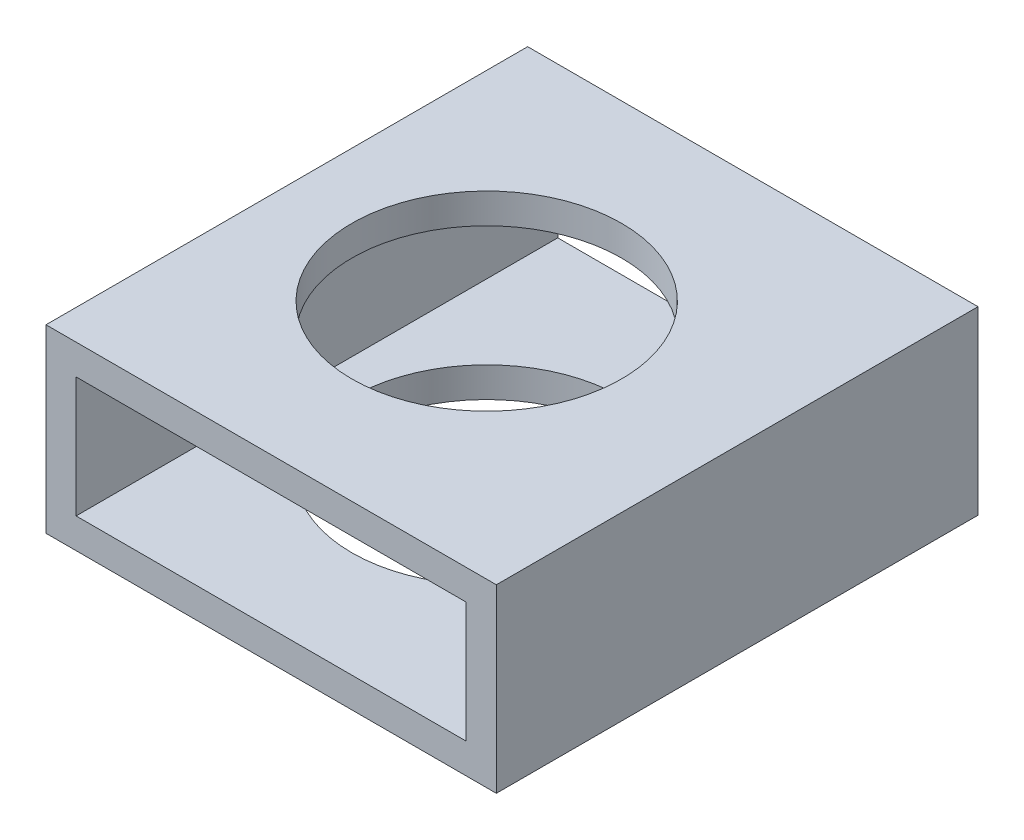
ISO-10303-21;
HEADER;
FILE_DESCRIPTION(('STEP AP214'),'2;1');
FILE_NAME('part.step','',(''),(''),'','','');
FILE_SCHEMA(('AUTOMOTIVE_DESIGN { 1 0 10303 214 1 1 1 1 }'));
ENDSEC;
DATA;
#1=APPLICATION_CONTEXT('core data for automotive mechanical design processes');
#2=APPLICATION_PROTOCOL_DEFINITION('international standard','automotive_design',2000,#1);
#3=PRODUCT_CONTEXT('',#1,'mechanical');
#4=PRODUCT('Part','Part','',(#3));
#5=PRODUCT_RELATED_PRODUCT_CATEGORY('part','',(#4));
#6=PRODUCT_DEFINITION_FORMATION('','',#4);
#7=PRODUCT_DEFINITION_CONTEXT('part definition',#1,'design');
#8=PRODUCT_DEFINITION('design','',#6,#7);
#9=PRODUCT_DEFINITION_SHAPE('','',#8);
#10=(LENGTH_UNIT() NAMED_UNIT(*) SI_UNIT(.MILLI.,.METRE.));
#11=(NAMED_UNIT(*) PLANE_ANGLE_UNIT() SI_UNIT($,.RADIAN.));
#12=(NAMED_UNIT(*) SI_UNIT($,.STERADIAN.) SOLID_ANGLE_UNIT());
#13=UNCERTAINTY_MEASURE_WITH_UNIT(LENGTH_MEASURE(1.E-05),#10,'distance_accuracy_value','');
#14=(GEOMETRIC_REPRESENTATION_CONTEXT(3) GLOBAL_UNCERTAINTY_ASSIGNED_CONTEXT((#13)) GLOBAL_UNIT_ASSIGNED_CONTEXT((#10,
#11,#12)) REPRESENTATION_CONTEXT('',''));
#15=CARTESIAN_POINT('',(0.,0.,0.));
#16=DIRECTION('',(0.,0.,1.));
#17=DIRECTION('',(1.,0.,0.));
#18=AXIS2_PLACEMENT_3D('',#15,#16,#17);
#19=CARTESIAN_POINT('',(-54.2622987401615,21.1125464261386,50.8));
#20=DIRECTION('',(1.,0.,0.));
#21=DIRECTION('',(0.,0.,-1.));
#22=AXIS2_PLACEMENT_3D('',#19,#20,#21);
#23=PLANE('',#22);
#24=DIRECTION('',(0.,-1.,0.));
#25=VECTOR('',#24,1.);
#26=CARTESIAN_POINT('',(-54.2622987401615,21.1125464261386,0.));
#27=LINE('',#26,#25);
#28=CARTESIAN_POINT('',(-54.2622987401615,21.1125464261386,0.));
#29=VERTEX_POINT('',#28);
#30=CARTESIAN_POINT('',(-54.2622987401615,2.06254642613858,0.));
#31=VERTEX_POINT('',#30);
#32=EDGE_CURVE('E134',#29,#31,#27,.T.);
#33=ORIENTED_EDGE('',*,*,#32,.T.);
#34=DIRECTION('',(0.,0.,-1.));
#35=VECTOR('',#34,1.);
#36=CARTESIAN_POINT('',(-54.2622987401615,2.06254642613858,50.8));
#37=LINE('',#36,#35);
#38=CARTESIAN_POINT('',(-54.2622987401615,2.06254642613858,50.8));
#39=VERTEX_POINT('',#38);
#40=EDGE_CURVE('E11',#39,#31,#37,.T.);
#41=ORIENTED_EDGE('',*,*,#40,.F.);
#42=DIRECTION('',(0.,-1.,0.));
#43=VECTOR('',#42,1.);
#44=CARTESIAN_POINT('',(-54.2622987401615,21.1125464261386,50.8));
#45=LINE('',#44,#43);
#46=CARTESIAN_POINT('',(-54.2622987401615,21.1125464261386,50.8));
#47=VERTEX_POINT('',#46);
#48=EDGE_CURVE('E138',#47,#39,#45,.T.);
#49=ORIENTED_EDGE('',*,*,#48,.F.);
#50=DIRECTION('',(0.,0.,-1.));
#51=VECTOR('',#50,1.);
#52=CARTESIAN_POINT('',(-54.2622987401615,21.1125464261386,50.8));
#53=LINE('',#52,#51);
#54=EDGE_CURVE('E148',#47,#29,#53,.T.);
#55=ORIENTED_EDGE('',*,*,#54,.T.);
#56=EDGE_LOOP('',(#33,#41,#49,#55));
#57=FACE_BOUND('',#56,.T.);
#58=ADVANCED_FACE('F33',(#57),#23,.F.);
#59=CARTESIAN_POINT('',(-54.2622987401615,2.06254642613858,50.8));
#60=DIRECTION('',(0.,1.,0.));
#61=DIRECTION('',(0.,0.,1.));
#62=AXIS2_PLACEMENT_3D('',#59,#60,#61);
#63=PLANE('',#62);
#64=CARTESIAN_POINT('',(-33.1802987401615,2.06254642613858,25.4));
#65=DIRECTION('',(0.,1.,0.));
#66=DIRECTION('',(0.,0.,1.));
#67=AXIS2_PLACEMENT_3D('',#64,#65,#66);
#68=CIRCLE('',#67,14.224);
#69=CARTESIAN_POINT('',(-33.1802987401615,2.06254642613858,39.624));
#70=VERTEX_POINT('',#69);
#71=EDGE_CURVE('E221',#70,#70,#68,.T.);
#72=ORIENTED_EDGE('',*,*,#71,.T.);
#73=EDGE_LOOP('',(#72));
#74=FACE_BOUND('',#73,.T.);
#75=DIRECTION('',(1.,0.,0.));
#76=VECTOR('',#75,1.);
#77=CARTESIAN_POINT('',(-54.2622987401615,2.06254642613858,0.));
#78=LINE('',#77,#76);
#79=CARTESIAN_POINT('',(-6.76429874016151,2.06254642613858,0.));
#80=VERTEX_POINT('',#79);
#81=EDGE_CURVE('E151',#31,#80,#78,.T.);
#82=ORIENTED_EDGE('',*,*,#81,.T.);
#83=DIRECTION('',(0.,0.,-1.));
#84=VECTOR('',#83,1.);
#85=CARTESIAN_POINT('',(-6.76429874016151,2.06254642613858,50.8));
#86=LINE('',#85,#84);
#87=CARTESIAN_POINT('',(-6.76429874016151,2.06254642613858,50.8));
#88=VERTEX_POINT('',#87);
#89=EDGE_CURVE('E41',#88,#80,#86,.T.);
#90=ORIENTED_EDGE('',*,*,#89,.F.);
#91=DIRECTION('',(1.,0.,0.));
#92=VECTOR('',#91,1.);
#93=CARTESIAN_POINT('',(-54.2622987401615,2.06254642613858,50.8));
#94=LINE('',#93,#92);
#95=EDGE_CURVE('E141',#39,#88,#94,.T.);
#96=ORIENTED_EDGE('',*,*,#95,.F.);
#97=ORIENTED_EDGE('',*,*,#40,.T.);
#98=EDGE_LOOP('',(#82,#90,#96,#97));
#99=FACE_BOUND('',#98,.T.);
#100=ADVANCED_FACE('F180',(#74,#99),#63,.F.);
#101=CARTESIAN_POINT('',(-6.76429874016151,21.1125464261386,50.8));
#102=DIRECTION('',(-1.,0.,0.));
#103=DIRECTION('',(0.,-1.,0.));
#104=AXIS2_PLACEMENT_3D('',#101,#102,#103);
#105=PLANE('',#104);
#106=DIRECTION('',(0.,1.,0.));
#107=VECTOR('',#106,1.);
#108=CARTESIAN_POINT('',(-6.76429874016151,21.1125464261386,0.));
#109=LINE('',#108,#107);
#110=CARTESIAN_POINT('',(-6.76429874016151,21.1125464261386,0.));
#111=VERTEX_POINT('',#110);
#112=EDGE_CURVE('E153',#80,#111,#109,.T.);
#113=ORIENTED_EDGE('',*,*,#112,.T.);
#114=DIRECTION('',(0.,0.,-1.));
#115=VECTOR('',#114,1.);
#116=CARTESIAN_POINT('',(-6.76429874016151,21.1125464261386,50.8));
#117=LINE('',#116,#115);
#118=CARTESIAN_POINT('',(-6.76429874016151,21.1125464261386,50.8));
#119=VERTEX_POINT('',#118);
#120=EDGE_CURVE('E158',#119,#111,#117,.T.);
#121=ORIENTED_EDGE('',*,*,#120,.F.);
#122=DIRECTION('',(0.,1.,0.));
#123=VECTOR('',#122,1.);
#124=CARTESIAN_POINT('',(-6.76429874016151,21.1125464261386,50.8));
#125=LINE('',#124,#123);
#126=EDGE_CURVE('E144',#88,#119,#125,.T.);
#127=ORIENTED_EDGE('',*,*,#126,.F.);
#128=ORIENTED_EDGE('',*,*,#89,.T.);
#129=EDGE_LOOP('',(#113,#121,#127,#128));
#130=FACE_BOUND('',#129,.T.);
#131=ADVANCED_FACE('F166',(#130),#105,.F.);
#132=CARTESIAN_POINT('',(-54.2622987401615,21.1125464261386,50.8));
#133=DIRECTION('',(0.,-1.,0.));
#134=DIRECTION('',(0.,0.,-1.));
#135=AXIS2_PLACEMENT_3D('',#132,#133,#134);
#136=PLANE('',#135);
#137=CARTESIAN_POINT('',(-33.1802987401615,21.1125464261386,25.4));
#138=DIRECTION('',(0.,1.,0.));
#139=DIRECTION('',(0.,0.,1.));
#140=AXIS2_PLACEMENT_3D('',#137,#138,#139);
#141=CIRCLE('',#140,14.224);
#142=CARTESIAN_POINT('',(-33.1802987401615,21.1125464261386,39.624));
#143=VERTEX_POINT('',#142);
#144=EDGE_CURVE('E226',#143,#143,#141,.T.);
#145=ORIENTED_EDGE('',*,*,#144,.F.);
#146=EDGE_LOOP('',(#145));
#147=FACE_BOUND('',#146,.T.);
#148=DIRECTION('',(-1.,0.,0.));
#149=VECTOR('',#148,1.);
#150=CARTESIAN_POINT('',(-54.2622987401615,21.1125464261386,0.));
#151=LINE('',#150,#149);
#152=EDGE_CURVE('E142',#111,#29,#151,.T.);
#153=ORIENTED_EDGE('',*,*,#152,.T.);
#154=ORIENTED_EDGE('',*,*,#54,.F.);
#155=DIRECTION('',(-1.,0.,0.));
#156=VECTOR('',#155,1.);
#157=CARTESIAN_POINT('',(-54.2622987401615,21.1125464261386,50.8));
#158=LINE('',#157,#156);
#159=EDGE_CURVE('E146',#119,#47,#158,.T.);
#160=ORIENTED_EDGE('',*,*,#159,.F.);
#161=ORIENTED_EDGE('',*,*,#120,.T.);
#162=EDGE_LOOP('',(#153,#154,#160,#161));
#163=FACE_BOUND('',#162,.T.);
#164=ADVANCED_FACE('F175',(#147,#163),#136,.F.);
#165=CARTESIAN_POINT('',(0.,0.,50.8));
#166=DIRECTION('',(0.,0.,1.));
#167=DIRECTION('',(1.,0.,0.));
#168=AXIS2_PLACEMENT_3D('',#165,#166,#167);
#169=PLANE('',#168);
#170=DIRECTION('',(-1.,0.,0.));
#171=VECTOR('',#170,1.);
#172=CARTESIAN_POINT('',(-9.93929874016151,5.23754642613858,50.8));
#173=LINE('',#172,#171);
#174=CARTESIAN_POINT('',(-9.93929874016151,5.23754642613858,50.8));
#175=VERTEX_POINT('',#174);
#176=CARTESIAN_POINT('',(-51.0872987401615,5.23754642613858,50.8));
#177=VERTEX_POINT('',#176);
#178=EDGE_CURVE('E100',#175,#177,#173,.T.);
#179=ORIENTED_EDGE('',*,*,#178,.T.);
#180=DIRECTION('',(0.,1.,0.));
#181=VECTOR('',#180,1.);
#182=CARTESIAN_POINT('',(-51.0872987401615,5.23754642613858,50.8));
#183=LINE('',#182,#181);
#184=CARTESIAN_POINT('',(-51.0872987401615,17.9375464261386,50.8));
#185=VERTEX_POINT('',#184);
#186=EDGE_CURVE('E109',#177,#185,#183,.T.);
#187=ORIENTED_EDGE('',*,*,#186,.T.);
#188=DIRECTION('',(1.,0.,0.));
#189=VECTOR('',#188,1.);
#190=CARTESIAN_POINT('',(-51.0872987401615,17.9375464261386,50.8));
#191=LINE('',#190,#189);
#192=CARTESIAN_POINT('',(-9.93929874016151,17.9375464261386,50.8));
#193=VERTEX_POINT('',#192);
#194=EDGE_CURVE('E48',#185,#193,#191,.T.);
#195=ORIENTED_EDGE('',*,*,#194,.T.);
#196=DIRECTION('',(0.,-1.,0.));
#197=VECTOR('',#196,1.);
#198=CARTESIAN_POINT('',(-9.93929874016151,17.9375464261386,50.8));
#199=LINE('',#198,#197);
#200=EDGE_CURVE('E106',#193,#175,#199,.T.);
#201=ORIENTED_EDGE('',*,*,#200,.T.);
#202=EDGE_LOOP('',(#179,#187,#195,#201));
#203=FACE_BOUND('',#202,.T.);
#204=ORIENTED_EDGE('',*,*,#48,.T.);
#205=ORIENTED_EDGE('',*,*,#95,.T.);
#206=ORIENTED_EDGE('',*,*,#126,.T.);
#207=ORIENTED_EDGE('',*,*,#159,.T.);
#208=EDGE_LOOP('',(#204,#205,#206,#207));
#209=FACE_BOUND('',#208,.T.);
#210=ADVANCED_FACE('F113',(#203,#209),#169,.T.);
#211=CARTESIAN_POINT('',(0.,0.,0.));
#212=DIRECTION('',(0.,0.,1.));
#213=DIRECTION('',(1.,0.,0.));
#214=AXIS2_PLACEMENT_3D('',#211,#212,#213);
#215=PLANE('',#214);
#216=DIRECTION('',(0.,1.,0.));
#217=VECTOR('',#216,1.);
#218=CARTESIAN_POINT('',(-51.0872987401615,5.23754642613858,0.));
#219=LINE('',#218,#217);
#220=CARTESIAN_POINT('',(-51.0872987401615,5.23754642613858,0.));
#221=VERTEX_POINT('',#220);
#222=CARTESIAN_POINT('',(-51.0872987401615,17.9375464261386,0.));
#223=VERTEX_POINT('',#222);
#224=EDGE_CURVE('E128',#221,#223,#219,.T.);
#225=ORIENTED_EDGE('',*,*,#224,.F.);
#226=DIRECTION('',(-1.,0.,0.));
#227=VECTOR('',#226,1.);
#228=CARTESIAN_POINT('',(-9.93929874016151,5.23754642613858,0.));
#229=LINE('',#228,#227);
#230=CARTESIAN_POINT('',(-9.93929874016151,5.23754642613858,0.));
#231=VERTEX_POINT('',#230);
#232=EDGE_CURVE('E56',#231,#221,#229,.T.);
#233=ORIENTED_EDGE('',*,*,#232,.F.);
#234=DIRECTION('',(0.,-1.,0.));
#235=VECTOR('',#234,1.);
#236=CARTESIAN_POINT('',(-9.93929874016151,17.9375464261386,0.));
#237=LINE('',#236,#235);
#238=CARTESIAN_POINT('',(-9.93929874016151,17.9375464261386,0.));
#239=VERTEX_POINT('',#238);
#240=EDGE_CURVE('E116',#239,#231,#237,.T.);
#241=ORIENTED_EDGE('',*,*,#240,.F.);
#242=DIRECTION('',(1.,0.,0.));
#243=VECTOR('',#242,1.);
#244=CARTESIAN_POINT('',(-51.0872987401615,17.9375464261386,0.));
#245=LINE('',#244,#243);
#246=EDGE_CURVE('E119',#223,#239,#245,.T.);
#247=ORIENTED_EDGE('',*,*,#246,.F.);
#248=EDGE_LOOP('',(#225,#233,#241,#247));
#249=FACE_BOUND('',#248,.T.);
#250=ORIENTED_EDGE('',*,*,#32,.F.);
#251=ORIENTED_EDGE('',*,*,#152,.F.);
#252=ORIENTED_EDGE('',*,*,#112,.F.);
#253=ORIENTED_EDGE('',*,*,#81,.F.);
#254=EDGE_LOOP('',(#250,#251,#252,#253));
#255=FACE_BOUND('',#254,.T.);
#256=ADVANCED_FACE('F172',(#249,#255),#215,.F.);
#257=CARTESIAN_POINT('',(-9.93929874016151,5.23754642613858,50.8));
#258=DIRECTION('',(0.,-1.,0.));
#259=DIRECTION('',(0.,0.,-1.));
#260=AXIS2_PLACEMENT_3D('',#257,#258,#259);
#261=PLANE('',#260);
#262=CARTESIAN_POINT('',(-33.1802987401615,5.23754642613858,25.4));
#263=DIRECTION('',(0.,-1.,0.));
#264=DIRECTION('',(0.,0.,-1.));
#265=AXIS2_PLACEMENT_3D('',#262,#263,#264);
#266=CIRCLE('',#265,14.224);
#267=CARTESIAN_POINT('',(-33.1802987401615,5.23754642613858,11.176));
#268=VERTEX_POINT('',#267);
#269=EDGE_CURVE('E122',#268,#268,#266,.T.);
#270=ORIENTED_EDGE('',*,*,#269,.T.);
#271=EDGE_LOOP('',(#270));
#272=FACE_BOUND('',#271,.T.);
#273=ORIENTED_EDGE('',*,*,#232,.T.);
#274=DIRECTION('',(0.,0.,-1.));
#275=VECTOR('',#274,1.);
#276=CARTESIAN_POINT('',(-51.0872987401615,5.23754642613858,50.8));
#277=LINE('',#276,#275);
#278=EDGE_CURVE('E96',#177,#221,#277,.T.);
#279=ORIENTED_EDGE('',*,*,#278,.F.);
#280=ORIENTED_EDGE('',*,*,#178,.F.);
#281=DIRECTION('',(0.,0.,-1.));
#282=VECTOR('',#281,1.);
#283=CARTESIAN_POINT('',(-9.93929874016151,5.23754642613858,50.8));
#284=LINE('',#283,#282);
#285=EDGE_CURVE('E132',#175,#231,#284,.T.);
#286=ORIENTED_EDGE('',*,*,#285,.T.);
#287=EDGE_LOOP('',(#273,#279,#280,#286));
#288=FACE_BOUND('',#287,.T.);
#289=ADVANCED_FACE('F98',(#272,#288),#261,.F.);
#290=CARTESIAN_POINT('',(-9.93929874016151,17.9375464261386,50.8));
#291=DIRECTION('',(1.,0.,0.));
#292=DIRECTION('',(0.,1.,0.));
#293=AXIS2_PLACEMENT_3D('',#290,#291,#292);
#294=PLANE('',#293);
#295=ORIENTED_EDGE('',*,*,#240,.T.);
#296=ORIENTED_EDGE('',*,*,#285,.F.);
#297=ORIENTED_EDGE('',*,*,#200,.F.);
#298=DIRECTION('',(0.,0.,-1.));
#299=VECTOR('',#298,1.);
#300=CARTESIAN_POINT('',(-9.93929874016151,17.9375464261386,50.8));
#301=LINE('',#300,#299);
#302=EDGE_CURVE('E135',#193,#239,#301,.T.);
#303=ORIENTED_EDGE('',*,*,#302,.T.);
#304=EDGE_LOOP('',(#295,#296,#297,#303));
#305=FACE_BOUND('',#304,.T.);
#306=ADVANCED_FACE('F200',(#305),#294,.F.);
#307=CARTESIAN_POINT('',(-51.0872987401615,17.9375464261386,50.8));
#308=DIRECTION('',(0.,1.,0.));
#309=DIRECTION('',(0.,0.,1.));
#310=AXIS2_PLACEMENT_3D('',#307,#308,#309);
#311=PLANE('',#310);
#312=CARTESIAN_POINT('',(-33.1802987401615,17.9375464261386,25.4));
#313=DIRECTION('',(0.,1.,0.));
#314=DIRECTION('',(0.,0.,1.));
#315=AXIS2_PLACEMENT_3D('',#312,#313,#314);
#316=CIRCLE('',#315,14.224);
#317=CARTESIAN_POINT('',(-33.1802987401615,17.9375464261386,39.624));
#318=VERTEX_POINT('',#317);
#319=EDGE_CURVE('E36',#318,#318,#316,.T.);
#320=ORIENTED_EDGE('',*,*,#319,.T.);
#321=EDGE_LOOP('',(#320));
#322=FACE_BOUND('',#321,.T.);
#323=ORIENTED_EDGE('',*,*,#246,.T.);
#324=ORIENTED_EDGE('',*,*,#302,.F.);
#325=ORIENTED_EDGE('',*,*,#194,.F.);
#326=DIRECTION('',(0.,0.,-1.));
#327=VECTOR('',#326,1.);
#328=CARTESIAN_POINT('',(-51.0872987401615,17.9375464261386,50.8));
#329=LINE('',#328,#327);
#330=EDGE_CURVE('E105',#185,#223,#329,.T.);
#331=ORIENTED_EDGE('',*,*,#330,.T.);
#332=EDGE_LOOP('',(#323,#324,#325,#331));
#333=FACE_BOUND('',#332,.T.);
#334=ADVANCED_FACE('F205',(#322,#333),#311,.F.);
#335=CARTESIAN_POINT('',(-51.0872987401615,5.23754642613858,50.8));
#336=DIRECTION('',(-1.,0.,0.));
#337=DIRECTION('',(0.,0.,1.));
#338=AXIS2_PLACEMENT_3D('',#335,#336,#337);
#339=PLANE('',#338);
#340=ORIENTED_EDGE('',*,*,#224,.T.);
#341=ORIENTED_EDGE('',*,*,#330,.F.);
#342=ORIENTED_EDGE('',*,*,#186,.F.);
#343=ORIENTED_EDGE('',*,*,#278,.T.);
#344=EDGE_LOOP('',(#340,#341,#342,#343));
#345=FACE_BOUND('',#344,.T.);
#346=ADVANCED_FACE('F110',(#345),#339,.F.);
#347=CARTESIAN_POINT('',(-33.1802987401615,2.06254642613858,25.4));
#348=DIRECTION('',(0.,1.,0.));
#349=DIRECTION('',(0.,0.,1.));
#350=AXIS2_PLACEMENT_3D('',#347,#348,#349);
#351=CYLINDRICAL_SURFACE('',#350,14.224);
#352=ORIENTED_EDGE('',*,*,#144,.T.);
#353=EDGE_LOOP('',(#352));
#354=FACE_BOUND('',#353,.T.);
#355=ORIENTED_EDGE('',*,*,#319,.F.);
#356=EDGE_LOOP('',(#355));
#357=FACE_BOUND('',#356,.T.);
#358=ADVANCED_FACE('F204',(#354,#357),#351,.F.);
#359=ORIENTED_EDGE('',*,*,#71,.F.);
#360=EDGE_LOOP('',(#359));
#361=FACE_BOUND('',#360,.T.);
#362=ORIENTED_EDGE('',*,*,#269,.F.);
#363=EDGE_LOOP('',(#362));
#364=FACE_BOUND('',#363,.T.);
#365=ADVANCED_FACE('F212',(#361,#364),#351,.F.);
#366=CLOSED_SHELL('',(#58,#100,#131,#164,#210,#256,#289,#306,#334,#346,#358,#365));
#367=MANIFOLD_SOLID_BREP('B2',#366);
#368=ADVANCED_BREP_SHAPE_REPRESENTATION('',(#18,#367),#14);
#369=SHAPE_DEFINITION_REPRESENTATION(#9,#368);
ENDSEC;
END-ISO-10303-21;
